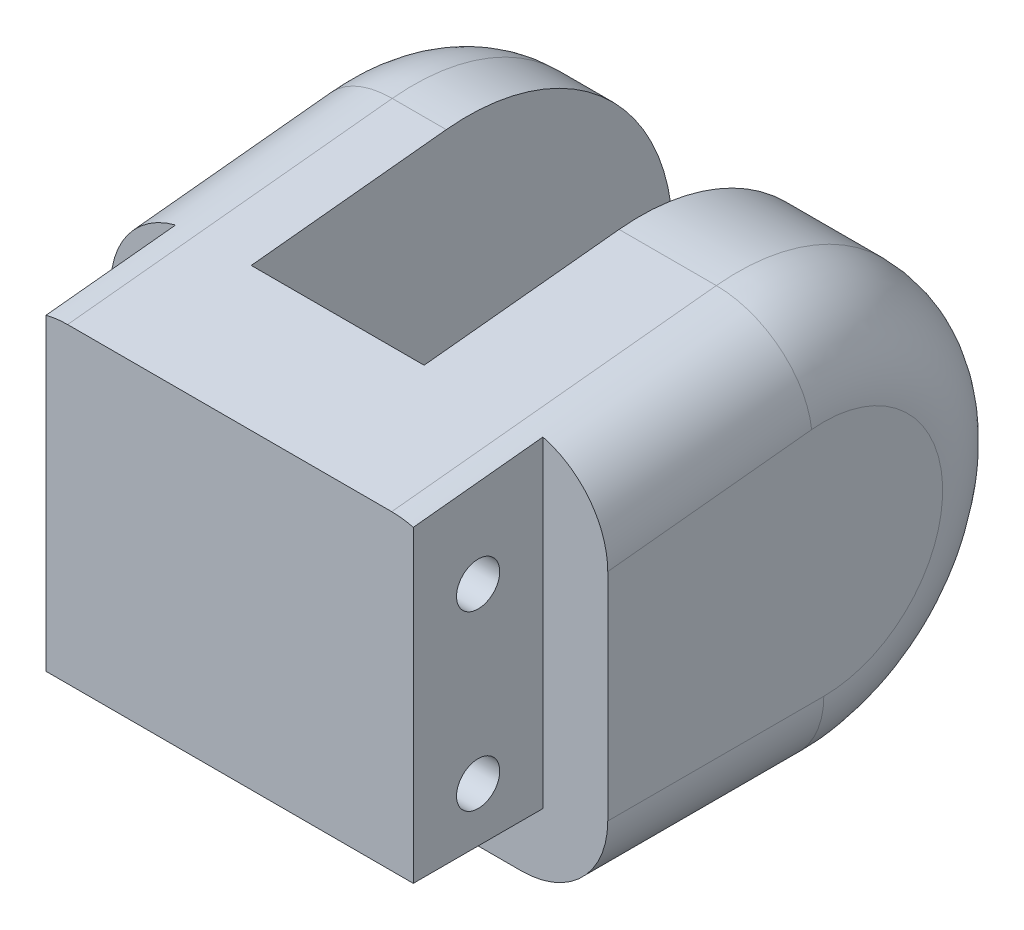
ISO-10303-21;
HEADER;
FILE_DESCRIPTION(('STEP AP214'),'2;1');
FILE_NAME('part.step','',(''),(''),'','','');
FILE_SCHEMA(('AUTOMOTIVE_DESIGN { 1 0 10303 214 1 1 1 1 }'));
ENDSEC;
DATA;
#1=APPLICATION_CONTEXT('core data for automotive mechanical design processes');
#2=APPLICATION_PROTOCOL_DEFINITION('international standard','automotive_design',2000,#1);
#3=PRODUCT_CONTEXT('',#1,'mechanical');
#4=PRODUCT('Part','Part','',(#3));
#5=PRODUCT_RELATED_PRODUCT_CATEGORY('part','',(#4));
#6=PRODUCT_DEFINITION_FORMATION('','',#4);
#7=PRODUCT_DEFINITION_CONTEXT('part definition',#1,'design');
#8=PRODUCT_DEFINITION('design','',#6,#7);
#9=PRODUCT_DEFINITION_SHAPE('','',#8);
#10=(LENGTH_UNIT() NAMED_UNIT(*) SI_UNIT(.MILLI.,.METRE.));
#11=(NAMED_UNIT(*) PLANE_ANGLE_UNIT() SI_UNIT($,.RADIAN.));
#12=(NAMED_UNIT(*) SI_UNIT($,.STERADIAN.) SOLID_ANGLE_UNIT());
#13=UNCERTAINTY_MEASURE_WITH_UNIT(LENGTH_MEASURE(1.E-05),#10,'distance_accuracy_value','');
#14=(GEOMETRIC_REPRESENTATION_CONTEXT(3) GLOBAL_UNCERTAINTY_ASSIGNED_CONTEXT((#13)) GLOBAL_UNIT_ASSIGNED_CONTEXT((#10,
#11,#12)) REPRESENTATION_CONTEXT('',''));
#15=CARTESIAN_POINT('',(0.,0.,0.));
#16=DIRECTION('',(0.,0.,1.));
#17=DIRECTION('',(1.,0.,0.));
#18=AXIS2_PLACEMENT_3D('',#15,#16,#17);
#19=CARTESIAN_POINT('',(-11.5112698372206,4.00000000000001,13.));
#20=DIRECTION('',(1.,0.,0.));
#21=DIRECTION('',(0.,-1.00000000000001,0.));
#22=AXIS2_PLACEMENT_3D('',#19,#20,#21);
#23=CYLINDRICAL_SURFACE('',#22,1.);
#24=CARTESIAN_POINT('',(-8.39999999999977,4.,13.));
#25=DIRECTION('',(1.,0.,0.));
#26=DIRECTION('',(0.,-1.00000000000001,0.));
#27=AXIS2_PLACEMENT_3D('',#24,#25,#26);
#28=CIRCLE('',#27,1.);
#29=CARTESIAN_POINT('',(-8.39999999999977,2.99999999999998,13.));
#30=VERTEX_POINT('',#29);
#31=EDGE_CURVE('E196',#30,#30,#28,.F.);
#32=ORIENTED_EDGE('',*,*,#31,.T.);
#33=EDGE_LOOP('',(#32));
#34=FACE_BOUND('',#33,.T.);
#35=CARTESIAN_POINT('',(1.10000000000022,4.,13.));
#36=DIRECTION('',(-1.,0.,0.));
#37=DIRECTION('',(0.,1.00000000000001,0.));
#38=AXIS2_PLACEMENT_3D('',#35,#36,#37);
#39=CIRCLE('',#38,1.);
#40=CARTESIAN_POINT('',(1.10000000000022,5.00000000000001,13.));
#41=VERTEX_POINT('',#40);
#42=EDGE_CURVE('E209',#41,#41,#39,.T.);
#43=ORIENTED_EDGE('',*,*,#42,.F.);
#44=EDGE_LOOP('',(#43));
#45=FACE_BOUND('',#44,.T.);
#46=ADVANCED_FACE('F16',(#34,#45),#23,.F.);
#47=CARTESIAN_POINT('',(-7.39999999999977,0.,0.));
#48=DIRECTION('',(1.,0.,0.));
#49=DIRECTION('',(0.,-1.00000000000001,0.));
#50=AXIS2_PLACEMENT_3D('',#47,#48,#49);
#51=TOROIDAL_SURFACE('',#50,5.5,4.);
#52=CARTESIAN_POINT('',(-7.39999999999977,5.47097143378143,0.564332854570415));
#53=DIRECTION('',(0.,0.102605973558259,-0.994722078869364));
#54=DIRECTION('',(0.,-0.994722078869364,-0.102605973558259));
#55=AXIS2_PLACEMENT_3D('',#52,#53,#54);
#56=CIRCLE('',#55,4.);
#57=CARTESIAN_POINT('',(-11.3999999999997,5.47097143378153,0.564332854570325));
#58=VERTEX_POINT('',#57);
#59=CARTESIAN_POINT('',(-7.39999999999977,9.44985974925883,0.97475674880345));
#60=VERTEX_POINT('',#59);
#61=EDGE_CURVE('E95',#58,#60,#56,.T.);
#62=ORIENTED_EDGE('',*,*,#61,.T.);
#63=CARTESIAN_POINT('',(-7.39999999999977,0.,0.));
#64=DIRECTION('',(1.,0.,0.));
#65=DIRECTION('',(0.,-1.00000000000001,0.));
#66=AXIS2_PLACEMENT_3D('',#63,#64,#65);
#67=CIRCLE('',#66,9.5);
#68=CARTESIAN_POINT('',(-7.39999999999977,-9.5000000000001,0.));
#69=VERTEX_POINT('',#68);
#70=EDGE_CURVE('E140',#69,#60,#67,.T.);
#71=ORIENTED_EDGE('',*,*,#70,.F.);
#72=CARTESIAN_POINT('',(-7.39999999999977,-5.50000000000001,0.));
#73=DIRECTION('',(0.,0.,-1.00000000000001));
#74=DIRECTION('',(0.,-1.00000000000001,0.));
#75=AXIS2_PLACEMENT_3D('',#72,#73,#74);
#76=CIRCLE('',#75,4.);
#77=CARTESIAN_POINT('',(-11.3999999999998,-5.50000000000001,0.));
#78=VERTEX_POINT('',#77);
#79=EDGE_CURVE('E105',#69,#78,#76,.T.);
#80=ORIENTED_EDGE('',*,*,#79,.T.);
#81=CARTESIAN_POINT('',(-11.3999999999998,0.,0.));
#82=DIRECTION('',(1.,0.,0.));
#83=DIRECTION('',(0.,-1.00000000000001,0.));
#84=AXIS2_PLACEMENT_3D('',#81,#82,#83);
#85=CIRCLE('',#84,5.5);
#86=EDGE_CURVE('E84',#78,#58,#85,.T.);
#87=ORIENTED_EDGE('',*,*,#86,.T.);
#88=EDGE_LOOP('',(#62,#71,#80,#87));
#89=FACE_BOUND('',#88,.T.);
#90=ADVANCED_FACE('F18',(#89),#51,.T.);
#91=CARTESIAN_POINT('',(-7.39999999999977,-5.50000000000001,0.));
#92=DIRECTION('',(0.,0.,1.00000000000001));
#93=DIRECTION('',(1.,0.,0.));
#94=AXIS2_PLACEMENT_3D('',#91,#92,#93);
#95=CYLINDRICAL_SURFACE('',#94,4.);
#96=DIRECTION('',(0.,0.,-1.00000000000001));
#97=VECTOR('',#96,1.);
#98=CARTESIAN_POINT('',(-7.39999999999977,-9.5000000000001,0.));
#99=LINE('',#98,#97);
#100=CARTESIAN_POINT('',(-7.39999999999977,-9.50000000000001,10.));
#101=VERTEX_POINT('',#100);
#102=EDGE_CURVE('E145',#69,#101,#99,.F.);
#103=ORIENTED_EDGE('',*,*,#102,.T.);
#104=CARTESIAN_POINT('',(-7.39999999999977,-5.50000000000001,9.99999999999999));
#105=DIRECTION('',(0.,0.,1.00000000000001));
#106=DIRECTION('',(1.,0.,0.));
#107=AXIS2_PLACEMENT_3D('',#104,#105,#106);
#108=CIRCLE('',#107,4.);
#109=CARTESIAN_POINT('',(-11.3999999999997,-5.5,10.));
#110=VERTEX_POINT('',#109);
#111=EDGE_CURVE('E117',#110,#101,#108,.T.);
#112=ORIENTED_EDGE('',*,*,#111,.F.);
#113=DIRECTION('',(0.,0.,1.00000000000001));
#114=VECTOR('',#113,1.);
#115=CARTESIAN_POINT('',(-11.3999999999998,-5.50000000000001,0.));
#116=LINE('',#115,#114);
#117=EDGE_CURVE('E107',#110,#78,#116,.F.);
#118=ORIENTED_EDGE('',*,*,#117,.T.);
#119=ORIENTED_EDGE('',*,*,#79,.F.);
#120=EDGE_LOOP('',(#103,#112,#118,#119));
#121=FACE_BOUND('',#120,.T.);
#122=ADVANCED_FACE('F409',(#121),#95,.T.);
#123=CARTESIAN_POINT('',(-11.3999999999998,0.,0.));
#124=DIRECTION('',(1.,0.,0.));
#125=DIRECTION('',(0.,-1.00000000000001,0.));
#126=AXIS2_PLACEMENT_3D('',#123,#124,#125);
#127=PLANE('',#126);
#128=DIRECTION('',(0.,1.00000000000001,0.));
#129=VECTOR('',#128,1.);
#130=CARTESIAN_POINT('',(-11.3999999999997,-9.50000000000001,10.));
#131=LINE('',#130,#129);
#132=CARTESIAN_POINT('',(-11.3999999999997,4.49767865764347,9.99999999999999));
#133=VERTEX_POINT('',#132);
#134=EDGE_CURVE('E87',#133,#110,#131,.F.);
#135=ORIENTED_EDGE('',*,*,#134,.F.);
#136=DIRECTION('',(0.,-0.10260597355826,0.994722078869363));
#137=VECTOR('',#136,1.);
#138=CARTESIAN_POINT('',(-11.3999999999997,5.47097143378153,0.564332854570325));
#139=LINE('',#138,#137);
#140=EDGE_CURVE('E80',#58,#133,#139,.T.);
#141=ORIENTED_EDGE('',*,*,#140,.F.);
#142=ORIENTED_EDGE('',*,*,#86,.F.);
#143=ORIENTED_EDGE('',*,*,#117,.F.);
#144=EDGE_LOOP('',(#135,#141,#142,#143));
#145=FACE_BOUND('',#144,.T.);
#146=ADVANCED_FACE('F82',(#145),#127,.F.);
#147=CARTESIAN_POINT('',(-8.39999999999977,0.,0.));
#148=DIRECTION('',(1.,0.,0.));
#149=DIRECTION('',(0.,-1.00000000000001,0.));
#150=AXIS2_PLACEMENT_3D('',#147,#148,#149);
#151=PLANE('',#150);
#152=DIRECTION('',(0.,1.00000000000001,0.));
#153=VECTOR('',#152,1.);
#154=CARTESIAN_POINT('',(-8.39999999999972,-9.50000000000001,16.));
#155=LINE('',#154,#153);
#156=CARTESIAN_POINT('',(-8.39999999999972,-6.50000000000003,16.));
#157=VERTEX_POINT('',#156);
#158=CARTESIAN_POINT('',(-8.39999999999972,7.77230940531957,16.));
#159=VERTEX_POINT('',#158);
#160=EDGE_CURVE('E113',#157,#159,#155,.T.);
#161=ORIENTED_EDGE('',*,*,#160,.T.);
#162=DIRECTION('',(0.,-0.10260597355826,0.994722078869363));
#163=VECTOR('',#162,1.);
#164=CARTESIAN_POINT('',(-8.39999999999972,8.39121176450849,9.99999999999999));
#165=LINE('',#164,#163);
#166=CARTESIAN_POINT('',(-8.39999999999972,8.39121176450849,9.99999999999999));
#167=VERTEX_POINT('',#166);
#168=EDGE_CURVE('E90',#167,#159,#165,.T.);
#169=ORIENTED_EDGE('',*,*,#168,.F.);
#170=DIRECTION('',(0.,1.00000000000001,0.));
#171=VECTOR('',#170,1.);
#172=CARTESIAN_POINT('',(-8.39999999999972,-9.50000000000015,10.0000000000001));
#173=LINE('',#172,#171);
#174=CARTESIAN_POINT('',(-8.39999999999972,-6.50000000000019,10.0000000000002));
#175=VERTEX_POINT('',#174);
#176=EDGE_CURVE('E148',#175,#167,#173,.T.);
#177=ORIENTED_EDGE('',*,*,#176,.F.);
#178=DIRECTION('',(0.,0.,-1.00000000000001));
#179=VECTOR('',#178,1.);
#180=CARTESIAN_POINT('',(-8.39999999999972,-6.50000000000003,16.));
#181=LINE('',#180,#179);
#182=EDGE_CURVE('E127',#175,#157,#181,.F.);
#183=ORIENTED_EDGE('',*,*,#182,.T.);
#184=EDGE_LOOP('',(#161,#169,#177,#183));
#185=FACE_BOUND('',#184,.T.);
#186=CARTESIAN_POINT('',(-8.39999999999972,-4.,13.));
#187=DIRECTION('',(1.,0.,0.));
#188=DIRECTION('',(0.,-1.00000000000001,0.));
#189=AXIS2_PLACEMENT_3D('',#186,#187,#188);
#190=CIRCLE('',#189,1.);
#191=CARTESIAN_POINT('',(-8.39999999999972,-5.00000000000002,13.));
#192=VERTEX_POINT('',#191);
#193=EDGE_CURVE('E91',#192,#192,#190,.F.);
#194=ORIENTED_EDGE('',*,*,#193,.F.);
#195=EDGE_LOOP('',(#194));
#196=FACE_BOUND('',#195,.T.);
#197=ORIENTED_EDGE('',*,*,#31,.F.);
#198=EDGE_LOOP('',(#197));
#199=FACE_BOUND('',#198,.T.);
#200=ADVANCED_FACE('F423',(#185,#196,#199),#151,.F.);
#201=CARTESIAN_POINT('',(-11.5112698372205,-4.,13.));
#202=DIRECTION('',(1.,0.,0.));
#203=DIRECTION('',(0.,-1.00000000000001,0.));
#204=AXIS2_PLACEMENT_3D('',#201,#202,#203);
#205=CYLINDRICAL_SURFACE('',#204,1.);
#206=ORIENTED_EDGE('',*,*,#193,.T.);
#207=EDGE_LOOP('',(#206));
#208=FACE_BOUND('',#207,.T.);
#209=CARTESIAN_POINT('',(1.10000000000022,-4.,13.));
#210=DIRECTION('',(-1.,0.,0.));
#211=DIRECTION('',(0.,1.00000000000001,0.));
#212=AXIS2_PLACEMENT_3D('',#209,#210,#211);
#213=CIRCLE('',#212,1.);
#214=CARTESIAN_POINT('',(1.10000000000022,-2.99999999999998,13.));
#215=VERTEX_POINT('',#214);
#216=EDGE_CURVE('E206',#215,#215,#213,.T.);
#217=ORIENTED_EDGE('',*,*,#216,.F.);
#218=EDGE_LOOP('',(#217));
#219=FACE_BOUND('',#218,.T.);
#220=ADVANCED_FACE('F469',(#208,#219),#205,.F.);
#221=CARTESIAN_POINT('',(-11.3999999999997,-9.50000000000001,16.));
#222=DIRECTION('',(0.,0.,-1.00000000000001));
#223=DIRECTION('',(-1.,0.,0.));
#224=AXIS2_PLACEMENT_3D('',#221,#222,#223);
#225=PLANE('',#224);
#226=DIRECTION('',(1.,0.,0.));
#227=VECTOR('',#226,1.);
#228=CARTESIAN_POINT('',(-11.3999999999997,-6.50000000000001,16.));
#229=LINE('',#228,#227);
#230=CARTESIAN_POINT('',(8.60000000000028,-6.49999999999989,16.0000000000004));
#231=VERTEX_POINT('',#230);
#232=EDGE_CURVE('E116',#157,#231,#229,.T.);
#233=ORIENTED_EDGE('',*,*,#232,.T.);
#234=DIRECTION('',(0.,-1.00000000000001,0.));
#235=VECTOR('',#234,1.);
#236=CARTESIAN_POINT('',(8.60000000000028,7.90000000000029,16.0000000000004));
#237=LINE('',#236,#235);
#238=CARTESIAN_POINT('',(8.60000000000028,7.77230940531984,16.0000000000004));
#239=VERTEX_POINT('',#238);
#240=EDGE_CURVE('E239',#239,#231,#237,.T.);
#241=ORIENTED_EDGE('',*,*,#240,.F.);
#242=CARTESIAN_POINT('',(7.60000000000023,3.87877629845471,16.0000000000004));
#243=DIRECTION('',(0.,0.,-1.00000000000001));
#244=DIRECTION('',(0.,1.00000000000001,0.));
#245=AXIS2_PLACEMENT_3D('',#242,#243,#244);
#246=ELLIPSE('',#245,4.02122370154545,4.);
#247=CARTESIAN_POINT('',(7.60000000000021,7.90000000000029,16.0000000000004));
#248=VERTEX_POINT('',#247);
#249=EDGE_CURVE('E235',#248,#239,#246,.T.);
#250=ORIENTED_EDGE('',*,*,#249,.F.);
#251=DIRECTION('',(-1.,0.,0.));
#252=VECTOR('',#251,1.);
#253=CARTESIAN_POINT('',(-11.3999999999997,7.9,16.));
#254=LINE('',#253,#252);
#255=CARTESIAN_POINT('',(-7.3999999999998,7.9,16.));
#256=VERTEX_POINT('',#255);
#257=EDGE_CURVE('E112',#256,#248,#254,.F.);
#258=ORIENTED_EDGE('',*,*,#257,.F.);
#259=CARTESIAN_POINT('',(-7.39999999999977,3.87877629845455,16.0000000000004));
#260=DIRECTION('',(0.,0.,-1.00000000000001));
#261=DIRECTION('',(0.,1.00000000000001,0.));
#262=AXIS2_PLACEMENT_3D('',#259,#260,#261);
#263=ELLIPSE('',#262,4.02122370154545,4.);
#264=EDGE_CURVE('E110',#159,#256,#263,.T.);
#265=ORIENTED_EDGE('',*,*,#264,.F.);
#266=ORIENTED_EDGE('',*,*,#160,.F.);
#267=EDGE_LOOP('',(#233,#241,#250,#258,#265,#266));
#268=FACE_BOUND('',#267,.T.);
#269=ADVANCED_FACE('F428',(#268),#225,.F.);
#270=CARTESIAN_POINT('',(-7.39999999999977,3.91046013530962,15.6928384286995));
#271=DIRECTION('',(0.,0.10260597355826,-0.994722078869363));
#272=DIRECTION('',(0.,-0.994722078869363,-0.10260597355826));
#273=AXIS2_PLACEMENT_3D('',#270,#271,#272);
#274=CYLINDRICAL_SURFACE('',#273,4.);
#275=ORIENTED_EDGE('',*,*,#61,.F.);
#276=ORIENTED_EDGE('',*,*,#140,.T.);
#277=CARTESIAN_POINT('',(-7.39999999999977,4.49767865764337,10.0000000000001));
#278=DIRECTION('',(0.,0.,1.00000000000001));
#279=DIRECTION('',(0.,1.00000000000001,0.));
#280=AXIS2_PLACEMENT_3D('',#277,#278,#279);
#281=ELLIPSE('',#280,4.02122370154545,4.);
#282=EDGE_CURVE('E114',#167,#133,#281,.T.);
#283=ORIENTED_EDGE('',*,*,#282,.F.);
#284=ORIENTED_EDGE('',*,*,#168,.T.);
#285=ORIENTED_EDGE('',*,*,#264,.T.);
#286=DIRECTION('',(0.,0.10260597355826,-0.994722078869363));
#287=VECTOR('',#286,1.);
#288=CARTESIAN_POINT('',(-7.39999999999977,9.44985974925883,0.97475674880345));
#289=LINE('',#288,#287);
#290=EDGE_CURVE('E98',#60,#256,#289,.F.);
#291=ORIENTED_EDGE('',*,*,#290,.F.);
#292=EDGE_LOOP('',(#275,#276,#283,#284,#285,#291));
#293=FACE_BOUND('',#292,.T.);
#294=ADVANCED_FACE('F96',(#293),#274,.T.);
#295=CARTESIAN_POINT('',(-11.3999999999998,9.44985974925901,0.974756748803263));
#296=DIRECTION('',(0.,0.994722078869363,0.10260597355826));
#297=DIRECTION('',(0.,0.10260597355826,-0.994722078869363));
#298=AXIS2_PLACEMENT_3D('',#295,#296,#297);
#299=PLANE('',#298);
#300=DIRECTION('',(1.,0.,0.));
#301=VECTOR('',#300,1.);
#302=CARTESIAN_POINT('',(-7.39999999999977,9.44985974925883,0.97475674880345));
#303=LINE('',#302,#301);
#304=CARTESIAN_POINT('',(-4.89999999999977,9.44985974925903,0.974756748803263));
#305=VERTEX_POINT('',#304);
#306=EDGE_CURVE('E165',#60,#305,#303,.T.);
#307=ORIENTED_EDGE('',*,*,#306,.F.);
#308=ORIENTED_EDGE('',*,*,#290,.T.);
#309=ORIENTED_EDGE('',*,*,#257,.T.);
#310=DIRECTION('',(0.,-0.102605973558259,0.994722078869362));
#311=VECTOR('',#310,1.);
#312=CARTESIAN_POINT('',(7.60000000000021,7.90000000000029,16.0000000000004));
#313=LINE('',#312,#311);
#314=CARTESIAN_POINT('',(7.60000000000023,9.44985974925904,0.97475674880327));
#315=VERTEX_POINT('',#314);
#316=EDGE_CURVE('E285',#248,#315,#313,.F.);
#317=ORIENTED_EDGE('',*,*,#316,.T.);
#318=DIRECTION('',(1.,0.,0.));
#319=VECTOR('',#318,1.);
#320=CARTESIAN_POINT('',(11.6000000000002,9.44985974925888,0.974756748803464));
#321=LINE('',#320,#319);
#322=CARTESIAN_POINT('',(3.10000000000022,9.44985974925897,0.974756748803325));
#323=VERTEX_POINT('',#322);
#324=EDGE_CURVE('E288',#315,#323,#321,.F.);
#325=ORIENTED_EDGE('',*,*,#324,.T.);
#326=DIRECTION('',(0.,-0.10260597355826,0.994722078869363));
#327=VECTOR('',#326,1.);
#328=CARTESIAN_POINT('',(3.10000000000022,9.44985974925897,0.974756748803325));
#329=LINE('',#328,#327);
#330=CARTESIAN_POINT('',(3.10000000000022,8.51890235918894,10.));
#331=VERTEX_POINT('',#330);
#332=EDGE_CURVE('E253',#323,#331,#329,.T.);
#333=ORIENTED_EDGE('',*,*,#332,.T.);
#334=DIRECTION('',(1.,0.,0.));
#335=VECTOR('',#334,1.);
#336=CARTESIAN_POINT('',(-4.89999999999979,8.51890235918893,10.));
#337=LINE('',#336,#335);
#338=CARTESIAN_POINT('',(-4.89999999999979,8.51890235918893,10.));
#339=VERTEX_POINT('',#338);
#340=EDGE_CURVE('E294',#339,#331,#337,.T.);
#341=ORIENTED_EDGE('',*,*,#340,.F.);
#342=DIRECTION('',(0.,-0.10260597355826,0.994722078869363));
#343=VECTOR('',#342,1.);
#344=CARTESIAN_POINT('',(-4.89999999999977,9.44985974925903,0.974756748803263));
#345=LINE('',#344,#343);
#346=EDGE_CURVE('E142',#305,#339,#345,.T.);
#347=ORIENTED_EDGE('',*,*,#346,.F.);
#348=EDGE_LOOP('',(#307,#308,#309,#317,#325,#333,#341,#347));
#349=FACE_BOUND('',#348,.T.);
#350=ADVANCED_FACE('F430',(#349),#299,.T.);
#351=CARTESIAN_POINT('',(-7.39999999999977,0.,0.));
#352=DIRECTION('',(1.,0.,0.));
#353=DIRECTION('',(0.,-1.00000000000001,0.));
#354=AXIS2_PLACEMENT_3D('',#351,#352,#353);
#355=CYLINDRICAL_SURFACE('',#354,9.5);
#356=DIRECTION('',(1.,0.,0.));
#357=VECTOR('',#356,1.);
#358=CARTESIAN_POINT('',(-7.39999999999977,-9.5000000000001,0.));
#359=LINE('',#358,#357);
#360=CARTESIAN_POINT('',(-4.89999999999977,-9.50000000000001,0.));
#361=VERTEX_POINT('',#360);
#362=EDGE_CURVE('E39',#361,#69,#359,.F.);
#363=ORIENTED_EDGE('',*,*,#362,.T.);
#364=ORIENTED_EDGE('',*,*,#70,.T.);
#365=ORIENTED_EDGE('',*,*,#306,.T.);
#366=CARTESIAN_POINT('',(-4.89999999999977,0.,-1.04083408558608E-13));
#367=DIRECTION('',(1.,0.,0.));
#368=DIRECTION('',(0.,-1.00000000000001,0.));
#369=AXIS2_PLACEMENT_3D('',#366,#367,#368);
#370=CIRCLE('',#369,9.5);
#371=EDGE_CURVE('E25',#361,#305,#370,.T.);
#372=ORIENTED_EDGE('',*,*,#371,.F.);
#373=EDGE_LOOP('',(#363,#364,#365,#372));
#374=FACE_BOUND('',#373,.T.);
#375=ADVANCED_FACE('F414',(#374),#355,.T.);
#376=CARTESIAN_POINT('',(-11.3999999999998,-9.50000000000002,0.));
#377=DIRECTION('',(0.,1.00000000000001,0.));
#378=DIRECTION('',(1.,0.,0.));
#379=AXIS2_PLACEMENT_3D('',#376,#377,#378);
#380=PLANE('',#379);
#381=ORIENTED_EDGE('',*,*,#102,.F.);
#382=ORIENTED_EDGE('',*,*,#362,.F.);
#383=DIRECTION('',(0.,0.,-1.00000000000001));
#384=VECTOR('',#383,1.);
#385=CARTESIAN_POINT('',(-4.89999999999977,-9.50000000000001,0.));
#386=LINE('',#385,#384);
#387=CARTESIAN_POINT('',(-4.89999999999977,-9.5,10.));
#388=VERTEX_POINT('',#387);
#389=EDGE_CURVE('E123',#388,#361,#386,.T.);
#390=ORIENTED_EDGE('',*,*,#389,.F.);
#391=DIRECTION('',(1.,0.,0.));
#392=VECTOR('',#391,1.);
#393=CARTESIAN_POINT('',(-11.3999999999997,-9.50000000000001,10.));
#394=LINE('',#393,#392);
#395=EDGE_CURVE('E147',#101,#388,#394,.T.);
#396=ORIENTED_EDGE('',*,*,#395,.F.);
#397=EDGE_LOOP('',(#381,#382,#390,#396));
#398=FACE_BOUND('',#397,.T.);
#399=ADVANCED_FACE('F412',(#398),#380,.F.);
#400=CARTESIAN_POINT('',(14.0915992541438,-9.50000000000001,10.));
#401=DIRECTION('',(0.,0.,1.00000000000001));
#402=DIRECTION('',(1.,0.,0.));
#403=AXIS2_PLACEMENT_3D('',#400,#401,#402);
#404=PLANE('',#403);
#405=DIRECTION('',(1.,0.,0.));
#406=VECTOR('',#405,1.);
#407=CARTESIAN_POINT('',(14.0915992541438,-6.5,10.));
#408=LINE('',#407,#406);
#409=CARTESIAN_POINT('',(-4.89999999999977,-6.5,10.));
#410=VERTEX_POINT('',#409);
#411=EDGE_CURVE('E120',#410,#175,#408,.F.);
#412=ORIENTED_EDGE('',*,*,#411,.T.);
#413=ORIENTED_EDGE('',*,*,#176,.T.);
#414=ORIENTED_EDGE('',*,*,#282,.T.);
#415=ORIENTED_EDGE('',*,*,#134,.T.);
#416=ORIENTED_EDGE('',*,*,#111,.T.);
#417=ORIENTED_EDGE('',*,*,#395,.T.);
#418=DIRECTION('',(0.,-1.00000000000001,0.));
#419=VECTOR('',#418,1.);
#420=CARTESIAN_POINT('',(-4.89999999999977,0.,10.));
#421=LINE('',#420,#419);
#422=EDGE_CURVE('E159',#410,#388,#421,.T.);
#423=ORIENTED_EDGE('',*,*,#422,.F.);
#424=EDGE_LOOP('',(#412,#413,#414,#415,#416,#417,#423));
#425=FACE_BOUND('',#424,.T.);
#426=ADVANCED_FACE('F419',(#425),#404,.T.);
#427=CARTESIAN_POINT('',(-4.89999999999977,0.,-1.04083408558608E-13));
#428=DIRECTION('',(1.,0.,0.));
#429=DIRECTION('',(0.,-1.00000000000001,0.));
#430=AXIS2_PLACEMENT_3D('',#427,#428,#429);
#431=PLANE('',#430);
#432=DIRECTION('',(0.,1.00000000000001,0.));
#433=VECTOR('',#432,1.);
#434=CARTESIAN_POINT('',(-4.89999999999977,0.,10.));
#435=LINE('',#434,#433);
#436=EDGE_CURVE('E11',#410,#339,#435,.T.);
#437=ORIENTED_EDGE('',*,*,#436,.F.);
#438=ORIENTED_EDGE('',*,*,#422,.T.);
#439=ORIENTED_EDGE('',*,*,#389,.T.);
#440=ORIENTED_EDGE('',*,*,#371,.T.);
#441=ORIENTED_EDGE('',*,*,#346,.T.);
#442=EDGE_LOOP('',(#437,#438,#439,#440,#441));
#443=FACE_BOUND('',#442,.T.);
#444=ADVANCED_FACE('F416',(#443),#431,.T.);
#445=CARTESIAN_POINT('',(-11.3999999999997,-6.50000000000001,16.));
#446=DIRECTION('',(0.,1.00000000000001,0.));
#447=DIRECTION('',(1.,0.,0.));
#448=AXIS2_PLACEMENT_3D('',#445,#446,#447);
#449=PLANE('',#448);
#450=ORIENTED_EDGE('',*,*,#232,.F.);
#451=ORIENTED_EDGE('',*,*,#182,.F.);
#452=ORIENTED_EDGE('',*,*,#411,.F.);
#453=DIRECTION('',(1.,0.,0.));
#454=VECTOR('',#453,1.);
#455=CARTESIAN_POINT('',(-4.89999999999978,-6.5,10.));
#456=LINE('',#455,#454);
#457=CARTESIAN_POINT('',(3.10000000000022,-6.50000000000001,9.99999999999999));
#458=VERTEX_POINT('',#457);
#459=EDGE_CURVE('E291',#458,#410,#456,.F.);
#460=ORIENTED_EDGE('',*,*,#459,.F.);
#461=DIRECTION('',(1.,0.,0.));
#462=VECTOR('',#461,1.);
#463=CARTESIAN_POINT('',(11.6000000000003,-6.5,10.));
#464=LINE('',#463,#462);
#465=CARTESIAN_POINT('',(8.60000000000028,-6.5,10.));
#466=VERTEX_POINT('',#465);
#467=EDGE_CURVE('E243',#458,#466,#464,.T.);
#468=ORIENTED_EDGE('',*,*,#467,.T.);
#469=DIRECTION('',(0.,0.,-1.00000000000001));
#470=VECTOR('',#469,1.);
#471=CARTESIAN_POINT('',(8.60000000000028,-6.49999999999989,16.0000000000004));
#472=LINE('',#471,#470);
#473=EDGE_CURVE('E259',#231,#466,#472,.T.);
#474=ORIENTED_EDGE('',*,*,#473,.F.);
#475=EDGE_LOOP('',(#450,#451,#452,#460,#468,#474));
#476=FACE_BOUND('',#475,.T.);
#477=ADVANCED_FACE('F359',(#476),#449,.F.);
#478=CARTESIAN_POINT('',(2.60000000000022,4.,13.));
#479=DIRECTION('',(1.,0.,0.));
#480=DIRECTION('',(0.,-1.00000000000001,0.));
#481=AXIS2_PLACEMENT_3D('',#478,#479,#480);
#482=PLANE('',#481);
#483=CARTESIAN_POINT('',(2.60000000000022,4.,13.));
#484=DIRECTION('',(-1.,0.,0.));
#485=DIRECTION('',(0.,1.00000000000001,0.));
#486=AXIS2_PLACEMENT_3D('',#483,#484,#485);
#487=CIRCLE('',#486,0.75);
#488=CARTESIAN_POINT('',(2.60000000000022,4.75000000000001,13.));
#489=VERTEX_POINT('',#488);
#490=EDGE_CURVE('E212',#489,#489,#487,.T.);
#491=ORIENTED_EDGE('',*,*,#490,.T.);
#492=EDGE_LOOP('',(#491));
#493=FACE_BOUND('',#492,.T.);
#494=CARTESIAN_POINT('',(2.60000000000022,4.,13.));
#495=DIRECTION('',(1.,0.,0.));
#496=DIRECTION('',(0.,-1.00000000000001,0.));
#497=AXIS2_PLACEMENT_3D('',#494,#495,#496);
#498=CIRCLE('',#497,1.);
#499=CARTESIAN_POINT('',(2.60000000000022,2.99999999999998,13.));
#500=VERTEX_POINT('',#499);
#501=EDGE_CURVE('E218',#500,#500,#498,.T.);
#502=ORIENTED_EDGE('',*,*,#501,.T.);
#503=EDGE_LOOP('',(#502));
#504=FACE_BOUND('',#503,.T.);
#505=ADVANCED_FACE('F487',(#493,#504),#482,.T.);
#506=CARTESIAN_POINT('',(2.60000000000022,4.,13.));
#507=DIRECTION('',(-1.,0.,0.));
#508=DIRECTION('',(0.,1.00000000000001,0.));
#509=AXIS2_PLACEMENT_3D('',#506,#507,#508);
#510=CYLINDRICAL_SURFACE('',#509,0.75);
#511=CARTESIAN_POINT('',(1.10000000000022,4.,13.));
#512=DIRECTION('',(-1.,0.,0.));
#513=DIRECTION('',(0.,1.00000000000001,0.));
#514=AXIS2_PLACEMENT_3D('',#511,#512,#513);
#515=CIRCLE('',#514,0.75);
#516=CARTESIAN_POINT('',(1.10000000000022,4.75000000000001,13.));
#517=VERTEX_POINT('',#516);
#518=EDGE_CURVE('E200',#517,#517,#515,.F.);
#519=ORIENTED_EDGE('',*,*,#518,.F.);
#520=EDGE_LOOP('',(#519));
#521=FACE_BOUND('',#520,.T.);
#522=ORIENTED_EDGE('',*,*,#490,.F.);
#523=EDGE_LOOP('',(#522));
#524=FACE_BOUND('',#523,.T.);
#525=ADVANCED_FACE('F512',(#521,#524),#510,.F.);
#526=CARTESIAN_POINT('',(1.10000000000022,4.,13.));
#527=DIRECTION('',(-1.,0.,0.));
#528=DIRECTION('',(0.,1.00000000000001,0.));
#529=AXIS2_PLACEMENT_3D('',#526,#527,#528);
#530=PLANE('',#529);
#531=ORIENTED_EDGE('',*,*,#518,.T.);
#532=EDGE_LOOP('',(#531));
#533=FACE_BOUND('',#532,.T.);
#534=ORIENTED_EDGE('',*,*,#42,.T.);
#535=EDGE_LOOP('',(#534));
#536=FACE_BOUND('',#535,.T.);
#537=ADVANCED_FACE('F522',(#533,#536),#530,.T.);
#538=CARTESIAN_POINT('',(2.60000000000022,-4.00000000000002,13.));
#539=DIRECTION('',(1.,0.,0.));
#540=DIRECTION('',(0.,-1.00000000000001,0.));
#541=AXIS2_PLACEMENT_3D('',#538,#539,#540);
#542=PLANE('',#541);
#543=CARTESIAN_POINT('',(2.60000000000022,-4.00000000000002,13.));
#544=DIRECTION('',(-1.,0.,0.));
#545=DIRECTION('',(0.,1.00000000000001,0.));
#546=AXIS2_PLACEMENT_3D('',#543,#544,#545);
#547=CIRCLE('',#546,0.75);
#548=CARTESIAN_POINT('',(2.60000000000022,-3.25000000000002,13.));
#549=VERTEX_POINT('',#548);
#550=EDGE_CURVE('E215',#549,#549,#547,.T.);
#551=ORIENTED_EDGE('',*,*,#550,.T.);
#552=EDGE_LOOP('',(#551));
#553=FACE_BOUND('',#552,.T.);
#554=CARTESIAN_POINT('',(2.60000000000022,-4.00000000000002,13.));
#555=DIRECTION('',(1.,0.,0.));
#556=DIRECTION('',(0.,-1.00000000000001,0.));
#557=AXIS2_PLACEMENT_3D('',#554,#555,#556);
#558=CIRCLE('',#557,1.);
#559=CARTESIAN_POINT('',(2.60000000000022,-5.00000000000004,13.));
#560=VERTEX_POINT('',#559);
#561=EDGE_CURVE('E221',#560,#560,#558,.T.);
#562=ORIENTED_EDGE('',*,*,#561,.T.);
#563=EDGE_LOOP('',(#562));
#564=FACE_BOUND('',#563,.T.);
#565=ADVANCED_FACE('F515',(#553,#564),#542,.T.);
#566=CARTESIAN_POINT('',(2.60000000000022,-4.00000000000002,13.));
#567=DIRECTION('',(-1.,0.,0.));
#568=DIRECTION('',(0.,1.00000000000001,0.));
#569=AXIS2_PLACEMENT_3D('',#566,#567,#568);
#570=CYLINDRICAL_SURFACE('',#569,0.75);
#571=CARTESIAN_POINT('',(1.10000000000022,-4.,13.));
#572=DIRECTION('',(-1.,0.,0.));
#573=DIRECTION('',(0.,1.00000000000001,0.));
#574=AXIS2_PLACEMENT_3D('',#571,#572,#573);
#575=CIRCLE('',#574,0.75);
#576=CARTESIAN_POINT('',(1.10000000000022,-3.24999999999999,13.));
#577=VERTEX_POINT('',#576);
#578=EDGE_CURVE('E203',#577,#577,#575,.F.);
#579=ORIENTED_EDGE('',*,*,#578,.F.);
#580=EDGE_LOOP('',(#579));
#581=FACE_BOUND('',#580,.T.);
#582=ORIENTED_EDGE('',*,*,#550,.F.);
#583=EDGE_LOOP('',(#582));
#584=FACE_BOUND('',#583,.T.);
#585=ADVANCED_FACE('F516',(#581,#584),#570,.F.);
#586=CARTESIAN_POINT('',(1.10000000000022,-4.,13.));
#587=DIRECTION('',(-1.,0.,0.));
#588=DIRECTION('',(0.,1.00000000000001,0.));
#589=AXIS2_PLACEMENT_3D('',#586,#587,#588);
#590=PLANE('',#589);
#591=ORIENTED_EDGE('',*,*,#578,.T.);
#592=EDGE_LOOP('',(#591));
#593=FACE_BOUND('',#592,.T.);
#594=ORIENTED_EDGE('',*,*,#216,.T.);
#595=EDGE_LOOP('',(#594));
#596=FACE_BOUND('',#595,.T.);
#597=ADVANCED_FACE('F488',(#593,#596),#590,.T.);
#598=CARTESIAN_POINT('',(2.60000000000022,4.,13.));
#599=DIRECTION('',(1.,0.,0.));
#600=DIRECTION('',(0.,-1.00000000000001,0.));
#601=AXIS2_PLACEMENT_3D('',#598,#599,#600);
#602=CYLINDRICAL_SURFACE('',#601,1.);
#603=ORIENTED_EDGE('',*,*,#501,.F.);
#604=EDGE_LOOP('',(#603));
#605=FACE_BOUND('',#604,.T.);
#606=CARTESIAN_POINT('',(8.60000000000023,4.00000000000006,13.0000000000001));
#607=DIRECTION('',(1.,0.,0.));
#608=DIRECTION('',(0.,-1.00000000000001,0.));
#609=AXIS2_PLACEMENT_3D('',#606,#607,#608);
#610=CIRCLE('',#609,1.);
#611=CARTESIAN_POINT('',(8.60000000000023,3.00000000000005,13.0000000000001));
#612=VERTEX_POINT('',#611);
#613=EDGE_CURVE('E224',#612,#612,#610,.T.);
#614=ORIENTED_EDGE('',*,*,#613,.T.);
#615=EDGE_LOOP('',(#614));
#616=FACE_BOUND('',#615,.T.);
#617=ADVANCED_FACE('F539',(#605,#616),#602,.F.);
#618=CARTESIAN_POINT('',(2.60000000000022,-4.00000000000002,13.));
#619=DIRECTION('',(1.,0.,0.));
#620=DIRECTION('',(0.,-1.00000000000001,0.));
#621=AXIS2_PLACEMENT_3D('',#618,#619,#620);
#622=CYLINDRICAL_SURFACE('',#621,1.);
#623=CARTESIAN_POINT('',(8.60000000000028,-3.99999999999999,13.));
#624=DIRECTION('',(1.,0.,0.));
#625=DIRECTION('',(0.,-1.00000000000001,0.));
#626=AXIS2_PLACEMENT_3D('',#623,#624,#625);
#627=CIRCLE('',#626,1.);
#628=CARTESIAN_POINT('',(8.60000000000028,-5.,13.));
#629=VERTEX_POINT('',#628);
#630=EDGE_CURVE('E227',#629,#629,#627,.T.);
#631=ORIENTED_EDGE('',*,*,#630,.T.);
#632=EDGE_LOOP('',(#631));
#633=FACE_BOUND('',#632,.T.);
#634=ORIENTED_EDGE('',*,*,#561,.F.);
#635=EDGE_LOOP('',(#634));
#636=FACE_BOUND('',#635,.T.);
#637=ADVANCED_FACE('F559',(#633,#636),#622,.F.);
#638=CARTESIAN_POINT('',(7.60000000000023,-5.5,0.));
#639=DIRECTION('',(0.,0.,1.00000000000001));
#640=DIRECTION('',(0.,-1.00000000000001,0.));
#641=AXIS2_PLACEMENT_3D('',#638,#639,#640);
#642=CYLINDRICAL_SURFACE('',#641,4.);
#643=CARTESIAN_POINT('',(7.60000000000023,-5.49999999999999,10.));
#644=DIRECTION('',(0.,0.,1.00000000000001));
#645=DIRECTION('',(0.,-1.00000000000001,0.));
#646=AXIS2_PLACEMENT_3D('',#643,#644,#645);
#647=CIRCLE('',#646,4.);
#648=CARTESIAN_POINT('',(11.6000000000003,-5.49999999999999,10.));
#649=VERTEX_POINT('',#648);
#650=CARTESIAN_POINT('',(7.60000000000022,-9.50000000000001,10.));
#651=VERTEX_POINT('',#650);
#652=EDGE_CURVE('E240',#649,#651,#647,.F.);
#653=ORIENTED_EDGE('',*,*,#652,.T.);
#654=DIRECTION('',(0.,0.,-1.00000000000001));
#655=VECTOR('',#654,1.);
#656=CARTESIAN_POINT('',(7.60000000000022,-9.5,0.));
#657=LINE('',#656,#655);
#658=CARTESIAN_POINT('',(7.60000000000022,-9.5,0.));
#659=VERTEX_POINT('',#658);
#660=EDGE_CURVE('E273',#659,#651,#657,.F.);
#661=ORIENTED_EDGE('',*,*,#660,.F.);
#662=CARTESIAN_POINT('',(7.60000000000023,-5.50000000000001,0.));
#663=DIRECTION('',(0.,0.,-1.00000000000001));
#664=DIRECTION('',(0.,1.00000000000001,0.));
#665=AXIS2_PLACEMENT_3D('',#662,#663,#664);
#666=CIRCLE('',#665,4.);
#667=CARTESIAN_POINT('',(11.6000000000002,-5.50000000000012,1.31838984174237E-13));
#668=VERTEX_POINT('',#667);
#669=EDGE_CURVE('E234',#668,#659,#666,.T.);
#670=ORIENTED_EDGE('',*,*,#669,.F.);
#671=DIRECTION('',(0.,0.,1.00000000000001));
#672=VECTOR('',#671,1.);
#673=CARTESIAN_POINT('',(11.6000000000002,-5.50000000000012,1.31838984174237E-13));
#674=LINE('',#673,#672);
#675=EDGE_CURVE('E230',#668,#649,#674,.T.);
#676=ORIENTED_EDGE('',*,*,#675,.T.);
#677=EDGE_LOOP('',(#653,#661,#670,#676));
#678=FACE_BOUND('',#677,.T.);
#679=ADVANCED_FACE('F567',(#678),#642,.T.);
#680=CARTESIAN_POINT('',(11.6000000000002,0.,0.));
#681=DIRECTION('',(1.,0.,0.));
#682=DIRECTION('',(0.,-1.00000000000001,0.));
#683=AXIS2_PLACEMENT_3D('',#680,#681,#682);
#684=PLANE('',#683);
#685=CARTESIAN_POINT('',(11.6000000000002,0.,0.));
#686=DIRECTION('',(1.,0.,0.));
#687=DIRECTION('',(0.,-1.00000000000001,0.));
#688=AXIS2_PLACEMENT_3D('',#685,#686,#687);
#689=CIRCLE('',#688,5.5);
#690=CARTESIAN_POINT('',(11.6000000000003,5.47097143378143,0.564332854570422));
#691=VERTEX_POINT('',#690);
#692=EDGE_CURVE('E231',#691,#668,#689,.F.);
#693=ORIENTED_EDGE('',*,*,#692,.F.);
#694=DIRECTION('',(0.,0.102605973558259,-0.994722078869362));
#695=VECTOR('',#694,1.);
#696=CARTESIAN_POINT('',(11.6000000000002,3.91046013530958,15.6928384286992));
#697=LINE('',#696,#695);
#698=CARTESIAN_POINT('',(11.6000000000003,4.49767865764347,10.));
#699=VERTEX_POINT('',#698);
#700=EDGE_CURVE('E282',#699,#691,#697,.T.);
#701=ORIENTED_EDGE('',*,*,#700,.F.);
#702=DIRECTION('',(0.,1.00000000000001,0.));
#703=VECTOR('',#702,1.);
#704=CARTESIAN_POINT('',(11.6000000000003,-6.5,10.));
#705=LINE('',#704,#703);
#706=EDGE_CURVE('E244',#699,#649,#705,.F.);
#707=ORIENTED_EDGE('',*,*,#706,.T.);
#708=ORIENTED_EDGE('',*,*,#675,.F.);
#709=EDGE_LOOP('',(#693,#701,#707,#708));
#710=FACE_BOUND('',#709,.T.);
#711=ADVANCED_FACE('F570',(#710),#684,.T.);
#712=CARTESIAN_POINT('',(7.60000000000023,0.,0.));
#713=DIRECTION('',(1.,0.,0.));
#714=DIRECTION('',(0.,-1.00000000000001,0.));
#715=AXIS2_PLACEMENT_3D('',#712,#713,#714);
#716=TOROIDAL_SURFACE('',#715,5.5,4.);
#717=CARTESIAN_POINT('',(7.60000000000023,0.,0.));
#718=DIRECTION('',(-1.,0.,0.));
#719=DIRECTION('',(0.,1.00000000000001,0.));
#720=AXIS2_PLACEMENT_3D('',#717,#718,#719);
#721=CIRCLE('',#720,9.5);
#722=EDGE_CURVE('E269',#315,#659,#721,.T.);
#723=ORIENTED_EDGE('',*,*,#722,.F.);
#724=CARTESIAN_POINT('',(7.60000000000023,5.47097143378155,0.564332854570297));
#725=DIRECTION('',(0.,0.102605973558259,-0.994722078869362));
#726=DIRECTION('',(0.,0.994722078869362,0.102605973558259));
#727=AXIS2_PLACEMENT_3D('',#724,#725,#726);
#728=CIRCLE('',#727,4.);
#729=EDGE_CURVE('E262',#691,#315,#728,.F.);
#730=ORIENTED_EDGE('',*,*,#729,.F.);
#731=ORIENTED_EDGE('',*,*,#692,.T.);
#732=ORIENTED_EDGE('',*,*,#669,.T.);
#733=EDGE_LOOP('',(#723,#730,#731,#732));
#734=FACE_BOUND('',#733,.T.);
#735=ADVANCED_FACE('F437',(#734),#716,.T.);
#736=CARTESIAN_POINT('',(11.6000000000002,-9.50000000000001,0.));
#737=DIRECTION('',(0.,-1.00000000000001,0.));
#738=DIRECTION('',(0.,0.,-1.00000000000001));
#739=AXIS2_PLACEMENT_3D('',#736,#737,#738);
#740=PLANE('',#739);
#741=DIRECTION('',(-1.,0.,0.));
#742=VECTOR('',#741,1.);
#743=CARTESIAN_POINT('',(7.60000000000022,-9.5,0.));
#744=LINE('',#743,#742);
#745=CARTESIAN_POINT('',(3.10000000000021,-9.50000000000001,0.));
#746=VERTEX_POINT('',#745);
#747=EDGE_CURVE('E272',#659,#746,#744,.T.);
#748=ORIENTED_EDGE('',*,*,#747,.F.);
#749=ORIENTED_EDGE('',*,*,#660,.T.);
#750=DIRECTION('',(1.,0.,0.));
#751=VECTOR('',#750,1.);
#752=CARTESIAN_POINT('',(11.6000000000003,-9.50000000000001,10.));
#753=LINE('',#752,#751);
#754=CARTESIAN_POINT('',(3.10000000000022,-9.5,10.));
#755=VERTEX_POINT('',#754);
#756=EDGE_CURVE('E248',#651,#755,#753,.F.);
#757=ORIENTED_EDGE('',*,*,#756,.T.);
#758=DIRECTION('',(0.,0.,-1.00000000000001));
#759=VECTOR('',#758,1.);
#760=CARTESIAN_POINT('',(3.10000000000021,-9.50000000000001,0.));
#761=LINE('',#760,#759);
#762=EDGE_CURVE('E254',#755,#746,#761,.T.);
#763=ORIENTED_EDGE('',*,*,#762,.T.);
#764=EDGE_LOOP('',(#748,#749,#757,#763));
#765=FACE_BOUND('',#764,.T.);
#766=ADVANCED_FACE('F386',(#765),#740,.T.);
#767=CARTESIAN_POINT('',(8.60000000000028,8.51890235918903,9.99999999999992));
#768=DIRECTION('',(-1.,0.,0.));
#769=DIRECTION('',(0.,1.00000000000001,0.));
#770=AXIS2_PLACEMENT_3D('',#767,#768,#769);
#771=PLANE('',#770);
#772=ORIENTED_EDGE('',*,*,#630,.F.);
#773=EDGE_LOOP('',(#772));
#774=FACE_BOUND('',#773,.T.);
#775=ORIENTED_EDGE('',*,*,#613,.F.);
#776=EDGE_LOOP('',(#775));
#777=FACE_BOUND('',#776,.T.);
#778=ORIENTED_EDGE('',*,*,#240,.T.);
#779=ORIENTED_EDGE('',*,*,#473,.T.);
#780=DIRECTION('',(0.,1.00000000000001,0.));
#781=VECTOR('',#780,1.);
#782=CARTESIAN_POINT('',(8.60000000000028,-6.5,10.));
#783=LINE('',#782,#781);
#784=CARTESIAN_POINT('',(8.60000000000028,8.39121176450853,10.));
#785=VERTEX_POINT('',#784);
#786=EDGE_CURVE('E249',#466,#785,#783,.T.);
#787=ORIENTED_EDGE('',*,*,#786,.T.);
#788=DIRECTION('',(0.,0.102605973558259,-0.994722078869362));
#789=VECTOR('',#788,1.);
#790=CARTESIAN_POINT('',(8.60000000000028,7.76300218087569,16.0902296555122));
#791=LINE('',#790,#789);
#792=EDGE_CURVE('E238',#239,#785,#791,.T.);
#793=ORIENTED_EDGE('',*,*,#792,.F.);
#794=EDGE_LOOP('',(#778,#779,#787,#793));
#795=FACE_BOUND('',#794,.T.);
#796=ADVANCED_FACE('F348',(#774,#777,#795),#771,.F.);
#797=CARTESIAN_POINT('',(11.6000000000003,-6.5,10.));
#798=DIRECTION('',(0.,0.,-1.00000000000001));
#799=DIRECTION('',(0.,1.00000000000001,0.));
#800=AXIS2_PLACEMENT_3D('',#797,#798,#799);
#801=PLANE('',#800);
#802=ORIENTED_EDGE('',*,*,#786,.F.);
#803=ORIENTED_EDGE('',*,*,#467,.F.);
#804=DIRECTION('',(0.,-1.00000000000001,0.));
#805=VECTOR('',#804,1.);
#806=CARTESIAN_POINT('',(3.10000000000021,0.,10.));
#807=LINE('',#806,#805);
#808=EDGE_CURVE('E293',#458,#755,#807,.T.);
#809=ORIENTED_EDGE('',*,*,#808,.T.);
#810=ORIENTED_EDGE('',*,*,#756,.F.);
#811=ORIENTED_EDGE('',*,*,#652,.F.);
#812=ORIENTED_EDGE('',*,*,#706,.F.);
#813=CARTESIAN_POINT('',(7.60000000000023,4.49767865764351,10.));
#814=DIRECTION('',(0.,0.,-1.00000000000001));
#815=DIRECTION('',(0.,1.00000000000001,0.));
#816=AXIS2_PLACEMENT_3D('',#813,#814,#815);
#817=ELLIPSE('',#816,4.02122370154545,4.);
#818=EDGE_CURVE('E245',#785,#699,#817,.T.);
#819=ORIENTED_EDGE('',*,*,#818,.F.);
#820=EDGE_LOOP('',(#802,#803,#809,#810,#811,#812,#819));
#821=FACE_BOUND('',#820,.T.);
#822=ADVANCED_FACE('F370',(#821),#801,.F.);
#823=CARTESIAN_POINT('',(7.60000000000023,3.91046013530975,15.6928384286995));
#824=DIRECTION('',(0.,0.102605973558259,-0.994722078869362));
#825=DIRECTION('',(0.,0.994722078869362,0.102605973558259));
#826=AXIS2_PLACEMENT_3D('',#823,#824,#825);
#827=CYLINDRICAL_SURFACE('',#826,4.);
#828=ORIENTED_EDGE('',*,*,#729,.T.);
#829=ORIENTED_EDGE('',*,*,#316,.F.);
#830=ORIENTED_EDGE('',*,*,#249,.T.);
#831=ORIENTED_EDGE('',*,*,#792,.T.);
#832=ORIENTED_EDGE('',*,*,#818,.T.);
#833=ORIENTED_EDGE('',*,*,#700,.T.);
#834=EDGE_LOOP('',(#828,#829,#830,#831,#832,#833));
#835=FACE_BOUND('',#834,.T.);
#836=ADVANCED_FACE('F443',(#835),#827,.T.);
#837=CARTESIAN_POINT('',(7.60000000000023,0.,0.));
#838=DIRECTION('',(-1.,0.,0.));
#839=DIRECTION('',(0.,1.00000000000001,0.));
#840=AXIS2_PLACEMENT_3D('',#837,#838,#839);
#841=CYLINDRICAL_SURFACE('',#840,9.5);
#842=ORIENTED_EDGE('',*,*,#747,.T.);
#843=CARTESIAN_POINT('',(3.10000000000022,0.,0.));
#844=DIRECTION('',(-1.,0.,0.));
#845=DIRECTION('',(0.,1.00000000000001,0.));
#846=AXIS2_PLACEMENT_3D('',#843,#844,#845);
#847=CIRCLE('',#846,9.5);
#848=EDGE_CURVE('E250',#746,#323,#847,.F.);
#849=ORIENTED_EDGE('',*,*,#848,.T.);
#850=ORIENTED_EDGE('',*,*,#324,.F.);
#851=ORIENTED_EDGE('',*,*,#722,.T.);
#852=EDGE_LOOP('',(#842,#849,#850,#851));
#853=FACE_BOUND('',#852,.T.);
#854=ADVANCED_FACE('F446',(#853),#841,.T.);
#855=CARTESIAN_POINT('',(3.10000000000022,0.,0.));
#856=DIRECTION('',(1.,0.,0.));
#857=DIRECTION('',(0.,-1.00000000000001,0.));
#858=AXIS2_PLACEMENT_3D('',#855,#856,#857);
#859=PLANE('',#858);
#860=ORIENTED_EDGE('',*,*,#332,.F.);
#861=ORIENTED_EDGE('',*,*,#848,.F.);
#862=ORIENTED_EDGE('',*,*,#762,.F.);
#863=ORIENTED_EDGE('',*,*,#808,.F.);
#864=DIRECTION('',(0.,-1.00000000000001,0.));
#865=VECTOR('',#864,1.);
#866=CARTESIAN_POINT('',(3.10000000000021,0.,10.));
#867=LINE('',#866,#865);
#868=EDGE_CURVE('E199',#331,#458,#867,.T.);
#869=ORIENTED_EDGE('',*,*,#868,.F.);
#870=EDGE_LOOP('',(#860,#861,#862,#863,#869));
#871=FACE_BOUND('',#870,.T.);
#872=ADVANCED_FACE('F380',(#871),#859,.F.);
#873=CARTESIAN_POINT('',(-4.89999999999978,-6.5,10.));
#874=DIRECTION('',(0.,0.,-1.00000000000001));
#875=DIRECTION('',(1.,0.,0.));
#876=AXIS2_PLACEMENT_3D('',#873,#874,#875);
#877=PLANE('',#876);
#878=ORIENTED_EDGE('',*,*,#868,.T.);
#879=ORIENTED_EDGE('',*,*,#459,.T.);
#880=ORIENTED_EDGE('',*,*,#436,.T.);
#881=ORIENTED_EDGE('',*,*,#340,.T.);
#882=EDGE_LOOP('',(#878,#879,#880,#881));
#883=FACE_BOUND('',#882,.T.);
#884=ADVANCED_FACE('F431',(#883),#877,.T.);
#885=CLOSED_SHELL('',(#46,#90,#122,#146,#200,#220,#269,#294,#350,#375,#399,#426,#444,#477,#505,
#525,#537,#565,#585,#597,#617,#637,#679,#711,#735,#766,#796,#822,#836,#854,#872,#884));
#886=MANIFOLD_SOLID_BREP('B1',#885);
#887=ADVANCED_BREP_SHAPE_REPRESENTATION('',(#18,#886),#14);
#888=SHAPE_DEFINITION_REPRESENTATION(#9,#887);
ENDSEC;
END-ISO-10303-21;
